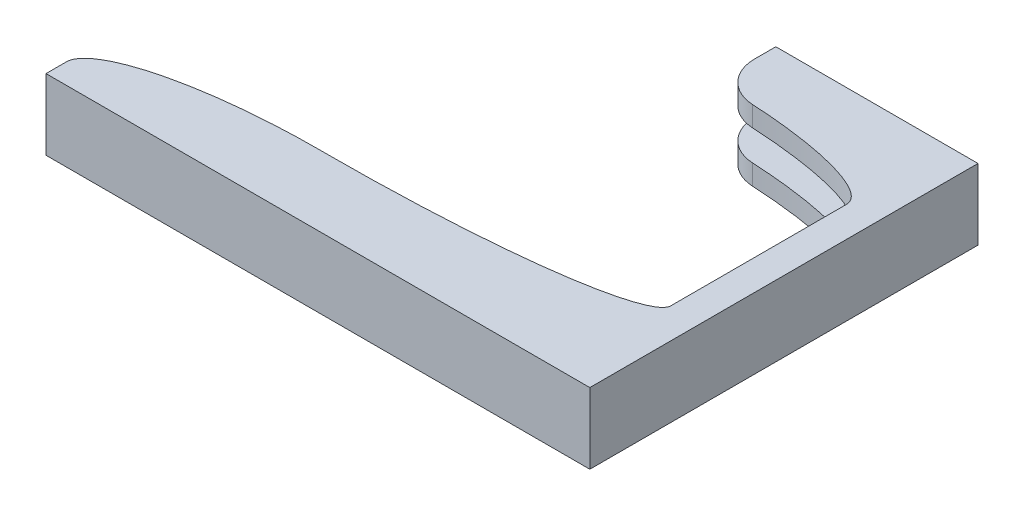
ISO-10303-21;
HEADER;
FILE_DESCRIPTION(('STEP AP214'),'2;1');
FILE_NAME('part.step','',(''),(''),'','','');
FILE_SCHEMA(('AUTOMOTIVE_DESIGN { 1 0 10303 214 1 1 1 1 }'));
ENDSEC;
DATA;
#1=APPLICATION_CONTEXT('core data for automotive mechanical design processes');
#2=APPLICATION_PROTOCOL_DEFINITION('international standard','automotive_design',2000,#1);
#3=PRODUCT_CONTEXT('',#1,'mechanical');
#4=PRODUCT('Part','Part','',(#3));
#5=PRODUCT_RELATED_PRODUCT_CATEGORY('part','',(#4));
#6=PRODUCT_DEFINITION_FORMATION('','',#4);
#7=PRODUCT_DEFINITION_CONTEXT('part definition',#1,'design');
#8=PRODUCT_DEFINITION('design','',#6,#7);
#9=PRODUCT_DEFINITION_SHAPE('','',#8);
#10=(LENGTH_UNIT() NAMED_UNIT(*) SI_UNIT(.MILLI.,.METRE.));
#11=(NAMED_UNIT(*) PLANE_ANGLE_UNIT() SI_UNIT($,.RADIAN.));
#12=(NAMED_UNIT(*) SI_UNIT($,.STERADIAN.) SOLID_ANGLE_UNIT());
#13=UNCERTAINTY_MEASURE_WITH_UNIT(LENGTH_MEASURE(1.E-05),#10,'distance_accuracy_value','');
#14=(GEOMETRIC_REPRESENTATION_CONTEXT(3) GLOBAL_UNCERTAINTY_ASSIGNED_CONTEXT((#13)) GLOBAL_UNIT_ASSIGNED_CONTEXT((#10,
#11,#12)) REPRESENTATION_CONTEXT('',''));
#15=CARTESIAN_POINT('',(0.,0.,0.));
#16=DIRECTION('',(0.,0.,1.));
#17=DIRECTION('',(1.,0.,0.));
#18=AXIS2_PLACEMENT_3D('',#15,#16,#17);
#19=CARTESIAN_POINT('',(-39.2209826108419,2.50000000000001,18.6662596522763));
#20=DIRECTION('',(0.,1.,0.));
#21=DIRECTION('',(0.,0.,1.));
#22=AXIS2_PLACEMENT_3D('',#19,#20,#21);
#23=CYLINDRICAL_SURFACE('',#22,2.);
#24=DIRECTION('',(0.,1.,0.));
#25=VECTOR('',#24,1.);
#26=CARTESIAN_POINT('',(-41.2209826108419,0.,18.6662596522763));
#27=LINE('',#26,#25);
#28=CARTESIAN_POINT('',(-41.2209826108419,2.5,18.6662596522763));
#29=VERTEX_POINT('',#28);
#30=CARTESIAN_POINT('',(-41.2209826108419,3.5,18.6662596522763));
#31=VERTEX_POINT('',#30);
#32=EDGE_CURVE('E655',#29,#31,#27,.T.);
#33=ORIENTED_EDGE('',*,*,#32,.F.);
#34=CARTESIAN_POINT('',(-39.2209826108419,2.5,18.6662596522763));
#35=DIRECTION('',(0.,1.,0.));
#36=DIRECTION('',(0.,0.,1.));
#37=AXIS2_PLACEMENT_3D('',#34,#35,#36);
#38=CIRCLE('',#37,2.);
#39=CARTESIAN_POINT('',(-39.3282724657844,2.5,20.6626418723806));
#40=VERTEX_POINT('',#39);
#41=EDGE_CURVE('E45',#40,#29,#38,.F.);
#42=ORIENTED_EDGE('',*,*,#41,.F.);
#43=DIRECTION('',(0.,1.,0.));
#44=VECTOR('',#43,1.);
#45=CARTESIAN_POINT('',(-39.328310749086,3.5,20.6633777436122));
#46=LINE('',#45,#44);
#47=CARTESIAN_POINT('',(-39.3282723988298,3.5,20.6626404961796));
#48=VERTEX_POINT('',#47);
#49=EDGE_CURVE('E782',#48,#40,#46,.F.);
#50=ORIENTED_EDGE('',*,*,#49,.F.);
#51=CARTESIAN_POINT('',(-39.2209826108419,3.5,18.6662596522763));
#52=DIRECTION('',(0.,-1.,0.));
#53=DIRECTION('',(0.,0.,-1.));
#54=AXIS2_PLACEMENT_3D('',#51,#52,#53);
#55=CIRCLE('',#54,2.);
#56=EDGE_CURVE('E12',#31,#48,#55,.F.);
#57=ORIENTED_EDGE('',*,*,#56,.F.);
#58=EDGE_LOOP('',(#33,#42,#50,#57));
#59=FACE_BOUND('',#58,.T.);
#60=ADVANCED_FACE('F37',(#59),#23,.T.);
#61=CARTESIAN_POINT('',(-39.2209826108419,0.,18.6662596522763));
#62=DIRECTION('',(0.,1.,0.));
#63=DIRECTION('',(0.,0.,1.));
#64=AXIS2_PLACEMENT_3D('',#61,#62,#63);
#65=CYLINDRICAL_SURFACE('',#64,2.);
#66=DIRECTION('',(0.,1.,0.));
#67=VECTOR('',#66,1.);
#68=CARTESIAN_POINT('',(-41.2209826108419,0.,18.6662596522763));
#69=LINE('',#68,#67);
#70=CARTESIAN_POINT('',(-41.2209826108419,0.,18.6662596522763));
#71=VERTEX_POINT('',#70);
#72=CARTESIAN_POINT('',(-41.2209826108419,0.999999999999998,18.6662596522763));
#73=VERTEX_POINT('',#72);
#74=EDGE_CURVE('E640',#71,#73,#69,.T.);
#75=ORIENTED_EDGE('',*,*,#74,.F.);
#76=CARTESIAN_POINT('',(-39.2209826108419,0.,18.6662596522763));
#77=DIRECTION('',(0.,-1.,0.));
#78=DIRECTION('',(0.,0.,-1.));
#79=AXIS2_PLACEMENT_3D('',#76,#77,#78);
#80=CIRCLE('',#79,2.);
#81=CARTESIAN_POINT('',(-39.3282724657844,0.,20.6626418723806));
#82=VERTEX_POINT('',#81);
#83=EDGE_CURVE('E642',#82,#71,#80,.T.);
#84=ORIENTED_EDGE('',*,*,#83,.F.);
#85=DIRECTION('',(0.,1.,0.));
#86=VECTOR('',#85,1.);
#87=CARTESIAN_POINT('',(-39.328310749086,0.999999999999998,20.6633777436122));
#88=LINE('',#87,#86);
#89=CARTESIAN_POINT('',(-39.3282719763754,0.999999999999998,20.6626405187616));
#90=VERTEX_POINT('',#89);
#91=EDGE_CURVE('E639',#90,#82,#88,.F.);
#92=ORIENTED_EDGE('',*,*,#91,.F.);
#93=CARTESIAN_POINT('',(-39.2209826108419,0.999999999999998,18.6662596522763));
#94=DIRECTION('',(0.,-1.,0.));
#95=DIRECTION('',(0.,0.,-1.));
#96=AXIS2_PLACEMENT_3D('',#93,#94,#95);
#97=CIRCLE('',#96,2.);
#98=EDGE_CURVE('E635',#73,#90,#97,.F.);
#99=ORIENTED_EDGE('',*,*,#98,.F.);
#100=EDGE_LOOP('',(#75,#84,#92,#99));
#101=FACE_BOUND('',#100,.T.);
#102=ADVANCED_FACE('F778',(#101),#65,.T.);
#103=CARTESIAN_POINT('',(-58.1209826108419,3.6,35.8131667407842));
#104=CARTESIAN_POINT('',(-58.1209826108419,3.2,35.8131667407842));
#105=CARTESIAN_POINT('',(-58.1209826108419,2.8,35.8131667407842));
#106=CARTESIAN_POINT('',(-58.1209826108419,2.4,35.8131667407842));
#107=CARTESIAN_POINT('',(-58.1209826108419,3.6,33.3131667407841));
#108=CARTESIAN_POINT('',(-58.1209826108419,3.2,33.3131667407841));
#109=CARTESIAN_POINT('',(-58.120982610846,2.8,33.3131667407841));
#110=CARTESIAN_POINT('',(-58.1209826108419,2.4,33.3131667407841));
#111=CARTESIAN_POINT('',(-48.1209826108419,3.6,33.3131667407842));
#112=CARTESIAN_POINT('',(-48.1209826108419,3.2,33.3131667407842));
#113=CARTESIAN_POINT('',(-48.1209826108419,2.8,33.3131667407842));
#114=CARTESIAN_POINT('',(-48.1209826108419,2.4,33.3131667407842));
#115=(BOUNDED_SURFACE() B_SPLINE_SURFACE(2,3,((#103,#104,#105,#106),(#107,#108,#109,#110),(#111,
#112,#113,#114)),.UNSPECIFIED.,.F.,.F.,.F.) B_SPLINE_SURFACE_WITH_KNOTS((3,3),(4,4),(0.,1.),
(-0.0001,0.0011),.UNSPECIFIED.) GEOMETRIC_REPRESENTATION_ITEM() RATIONAL_B_SPLINE_SURFACE(((1.,
1.,1.,1.),(0.707106781186547,0.707106781186547,0.707106781186547,0.707106781186547),(1.,1.,1.,1.))) REPRESENTATION_ITEM('') SURFACE());
#116=CARTESIAN_POINT('',(-58.1209826108419,2.4,35.8131667407842));
#117=CARTESIAN_POINT('',(-58.1209826108419,2.8,35.8131667407842));
#118=CARTESIAN_POINT('',(-58.1209826108419,3.2,35.8131667407842));
#119=CARTESIAN_POINT('',(-58.1209826108419,3.6,35.8131667407842));
#120=(BOUNDED_CURVE() B_SPLINE_CURVE(3,(#116,#117,#118,#119),.UNSPECIFIED.,.F.,
.F.) B_SPLINE_CURVE_WITH_KNOTS((4,4),(-0.0001,0.0011),
.UNSPECIFIED.) CURVE() GEOMETRIC_REPRESENTATION_ITEM() RATIONAL_B_SPLINE_CURVE((1.,1.,1.,1.)) REPRESENTATION_ITEM(''));
#121=CARTESIAN_POINT('',(-58.1209826108419,3.5,35.8131667407842));
#122=VERTEX_POINT('',#121);
#123=CARTESIAN_POINT('',(-58.1209826108419,2.5,35.8131667407842));
#124=VERTEX_POINT('',#123);
#125=EDGE_CURVE('E699',#122,#124,#120,.F.);
#126=CARTESIAN_POINT('',(-58.1209826108419,3.5,35.8131667407842));
#127=CARTESIAN_POINT('',(-58.120982610842,3.5,33.3131667407841));
#128=CARTESIAN_POINT('',(-48.1209826108419,3.5,33.3131667407842));
#129=(BOUNDED_CURVE() B_SPLINE_CURVE(2,(#126,#127,#128),.UNSPECIFIED.,.F.,
.F.) B_SPLINE_CURVE_WITH_KNOTS((3,3),(0.,1.),
.UNSPECIFIED.) CURVE() GEOMETRIC_REPRESENTATION_ITEM() RATIONAL_B_SPLINE_CURVE((1.,
0.707106781186547,1.)) REPRESENTATION_ITEM(''));
#130=CARTESIAN_POINT('',(-48.1209826108419,3.5,33.3131667407842));
#131=VERTEX_POINT('',#130);
#132=EDGE_CURVE('E705',#131,#122,#129,.F.);
#133=CARTESIAN_POINT('',(-48.1209826108419,3.6,33.3131667407842));
#134=CARTESIAN_POINT('',(-48.1209826108419,3.2,33.3131667407842));
#135=CARTESIAN_POINT('',(-48.1209826108419,2.8,33.3131667407842));
#136=CARTESIAN_POINT('',(-48.1209826108419,2.4,33.3131667407842));
#137=(BOUNDED_CURVE() B_SPLINE_CURVE(3,(#133,#134,#135,#136),.UNSPECIFIED.,.F.,
.F.) B_SPLINE_CURVE_WITH_KNOTS((4,4),(-0.0001,0.0011),
.UNSPECIFIED.) CURVE() GEOMETRIC_REPRESENTATION_ITEM() RATIONAL_B_SPLINE_CURVE((1.,1.,1.,1.)) REPRESENTATION_ITEM(''));
#138=CARTESIAN_POINT('',(-48.1209826108419,2.5,33.3131667407842));
#139=VERTEX_POINT('',#138);
#140=EDGE_CURVE('E703',#139,#131,#137,.F.);
#141=CARTESIAN_POINT('',(-48.1209826108419,2.5,33.3131667407842));
#142=CARTESIAN_POINT('',(-58.1209826108427,2.5,33.3131667407841));
#143=CARTESIAN_POINT('',(-58.1209826108419,2.5,35.8131667407842));
#144=(BOUNDED_CURVE() B_SPLINE_CURVE(2,(#141,#142,#143),.UNSPECIFIED.,.F.,
.F.) B_SPLINE_CURVE_WITH_KNOTS((3,3),(0.,1.),
.UNSPECIFIED.) CURVE() GEOMETRIC_REPRESENTATION_ITEM() RATIONAL_B_SPLINE_CURVE((1.,
0.707106781186547,1.)) REPRESENTATION_ITEM(''));
#145=EDGE_CURVE('E564',#124,#139,#144,.F.);
#146=ORIENTED_EDGE('',*,*,#125,.F.);
#147=ORIENTED_EDGE('',*,*,#132,.F.);
#148=ORIENTED_EDGE('',*,*,#140,.F.);
#149=ORIENTED_EDGE('',*,*,#145,.F.);
#150=EDGE_LOOP('',(#146,#147,#148,#149));
#151=FACE_BOUND('',#150,.T.);
#152=ADVANCED_FACE('F394',(#151),#115,.T.);
#153=CARTESIAN_POINT('',(-58.1209826108419,1.1,35.8131667407842));
#154=CARTESIAN_POINT('',(-58.1209826108419,0.7,35.8131667407842));
#155=CARTESIAN_POINT('',(-58.1209826108419,0.3,35.8131667407842));
#156=CARTESIAN_POINT('',(-58.1209826108419,-0.0999999999999998,35.8131667407842));
#157=CARTESIAN_POINT('',(-58.1209826108419,1.1,33.3131667407841));
#158=CARTESIAN_POINT('',(-58.120982610846,0.7,33.3131667407841));
#159=CARTESIAN_POINT('',(-58.1209826108419,0.3,33.3131667407841));
#160=CARTESIAN_POINT('',(-58.1209826108419,-0.0999999999999998,33.3131667407841));
#161=CARTESIAN_POINT('',(-48.1209826108419,1.1,33.3131667407842));
#162=CARTESIAN_POINT('',(-48.1209826108419,0.7,33.3131667407842));
#163=CARTESIAN_POINT('',(-48.1209826108419,0.3,33.3131667407842));
#164=CARTESIAN_POINT('',(-48.1209826108419,-0.0999999999999998,33.3131667407842));
#165=(BOUNDED_SURFACE() B_SPLINE_SURFACE(2,3,((#153,#154,#155,#156),(#157,#158,#159,#160),(#161,
#162,#163,#164)),.UNSPECIFIED.,.F.,.F.,.F.) B_SPLINE_SURFACE_WITH_KNOTS((3,3),(4,4),(0.,1.),
(0.0024,0.0036),.UNSPECIFIED.) GEOMETRIC_REPRESENTATION_ITEM() RATIONAL_B_SPLINE_SURFACE(((1.,
1.,1.,1.),(0.707106781186547,0.707106781186547,0.707106781186547,0.707106781186547),(1.,1.,1.,1.))) REPRESENTATION_ITEM('') SURFACE());
#166=CARTESIAN_POINT('',(-58.1209826108419,-0.0999999999999998,35.8131667407842));
#167=CARTESIAN_POINT('',(-58.1209826108419,0.3,35.8131667407842));
#168=CARTESIAN_POINT('',(-58.1209826108419,0.7,35.8131667407842));
#169=CARTESIAN_POINT('',(-58.1209826108419,1.1,35.8131667407842));
#170=(BOUNDED_CURVE() B_SPLINE_CURVE(3,(#166,#167,#168,#169),.UNSPECIFIED.,.F.,
.F.) B_SPLINE_CURVE_WITH_KNOTS((4,4),(0.0024,0.0036),
.UNSPECIFIED.) CURVE() GEOMETRIC_REPRESENTATION_ITEM() RATIONAL_B_SPLINE_CURVE((1.,1.,1.,1.)) REPRESENTATION_ITEM(''));
#171=CARTESIAN_POINT('',(-58.1209826108419,1.,35.8131667407842));
#172=VERTEX_POINT('',#171);
#173=CARTESIAN_POINT('',(-58.1209826108419,0.,35.8131667407842));
#174=VERTEX_POINT('',#173);
#175=EDGE_CURVE('E467',#172,#174,#170,.F.);
#176=CARTESIAN_POINT('',(-58.1209826108418,1.,35.8131667407842));
#177=CARTESIAN_POINT('',(-58.1209826108427,1.,33.3131667407841));
#178=CARTESIAN_POINT('',(-48.1209826108419,1.,33.3131667407842));
#179=(BOUNDED_CURVE() B_SPLINE_CURVE(2,(#176,#177,#178),.UNSPECIFIED.,.F.,
.F.) B_SPLINE_CURVE_WITH_KNOTS((3,3),(0.,1.),
.UNSPECIFIED.) CURVE() GEOMETRIC_REPRESENTATION_ITEM() RATIONAL_B_SPLINE_CURVE((1.,
0.707106781186547,1.)) REPRESENTATION_ITEM(''));
#180=CARTESIAN_POINT('',(-48.1209826108419,1.,33.3131667407842));
#181=VERTEX_POINT('',#180);
#182=EDGE_CURVE('E605',#181,#172,#179,.F.);
#183=CARTESIAN_POINT('',(-48.1209826108419,1.1,33.3131667407842));
#184=CARTESIAN_POINT('',(-48.1209826108419,0.7,33.3131667407842));
#185=CARTESIAN_POINT('',(-48.1209826108419,0.3,33.3131667407842));
#186=CARTESIAN_POINT('',(-48.1209826108419,-0.0999999999999998,33.3131667407842));
#187=(BOUNDED_CURVE() B_SPLINE_CURVE(3,(#183,#184,#185,#186),.UNSPECIFIED.,.F.,
.F.) B_SPLINE_CURVE_WITH_KNOTS((4,4),(0.0024,0.0036),
.UNSPECIFIED.) CURVE() GEOMETRIC_REPRESENTATION_ITEM() RATIONAL_B_SPLINE_CURVE((1.,1.,1.,1.)) REPRESENTATION_ITEM(''));
#188=CARTESIAN_POINT('',(-48.1209826108419,0.,33.3131667407842));
#189=VERTEX_POINT('',#188);
#190=EDGE_CURVE('E593',#189,#181,#187,.F.);
#191=CARTESIAN_POINT('',(-48.1209826108419,0.,33.3131667407842));
#192=CARTESIAN_POINT('',(-58.1209826108419,0.,33.3131667407841));
#193=CARTESIAN_POINT('',(-58.1209826108419,0.,35.8131667407842));
#194=(BOUNDED_CURVE() B_SPLINE_CURVE(2,(#191,#192,#193),.UNSPECIFIED.,.F.,
.F.) B_SPLINE_CURVE_WITH_KNOTS((3,3),(0.,1.),
.UNSPECIFIED.) CURVE() GEOMETRIC_REPRESENTATION_ITEM() RATIONAL_B_SPLINE_CURVE((1.,
0.707106781186547,1.)) REPRESENTATION_ITEM(''));
#195=EDGE_CURVE('E704',#174,#189,#194,.F.);
#196=ORIENTED_EDGE('',*,*,#175,.F.);
#197=ORIENTED_EDGE('',*,*,#182,.F.);
#198=ORIENTED_EDGE('',*,*,#190,.F.);
#199=ORIENTED_EDGE('',*,*,#195,.F.);
#200=EDGE_LOOP('',(#196,#197,#198,#199));
#201=FACE_BOUND('',#200,.T.);
#202=ADVANCED_FACE('F380',(#201),#165,.T.);
#203=CARTESIAN_POINT('',(-41.2209826108419,2.4,20.6131667407842));
#204=CARTESIAN_POINT('',(-41.2209826108419,2.8,20.6131667407842));
#205=CARTESIAN_POINT('',(-41.2209826108419,3.2,20.6131667407842));
#206=CARTESIAN_POINT('',(-41.2209826108419,3.6,20.6131667407842));
#207=CARTESIAN_POINT('',(-32.7209826108419,2.4,20.6131667407842));
#208=CARTESIAN_POINT('',(-32.7209826108419,2.8,20.6131667407842));
#209=CARTESIAN_POINT('',(-32.7209826108419,3.2,20.6131667407842));
#210=CARTESIAN_POINT('',(-32.7209826108419,3.6,20.6131667407842));
#211=CARTESIAN_POINT('',(-32.7209826108419,2.4,22.6131667407842));
#212=CARTESIAN_POINT('',(-32.7209826108419,2.8,22.6131667407842));
#213=CARTESIAN_POINT('',(-32.7209826108419,3.2,22.6131667407842));
#214=CARTESIAN_POINT('',(-32.7209826108419,3.6,22.6131667407842));
#215=(BOUNDED_SURFACE() B_SPLINE_SURFACE(2,3,((#203,#204,#205,#206),(#207,#208,#209,#210),(#211,
#212,#213,#214)),.UNSPECIFIED.,.F.,.F.,.F.) B_SPLINE_SURFACE_WITH_KNOTS((3,3),(4,4),(0.,1.),
(0.0024,0.0036),.UNSPECIFIED.) GEOMETRIC_REPRESENTATION_ITEM() RATIONAL_B_SPLINE_SURFACE(((1.,
1.,1.,1.),(0.707106781186548,0.707106781186548,0.707106781186548,0.707106781186548),(1.,1.,1.,1.))) REPRESENTATION_ITEM('') SURFACE());
#216=CARTESIAN_POINT('',(-32.7209826108419,3.5,22.6131667407842));
#217=CARTESIAN_POINT('',(-32.7209826108419,3.5,20.6131667407842));
#218=CARTESIAN_POINT('',(-41.2209826108419,3.5,20.6131667407842));
#219=(BOUNDED_CURVE() B_SPLINE_CURVE(2,(#216,#217,#218),.UNSPECIFIED.,.F.,
.F.) B_SPLINE_CURVE_WITH_KNOTS((3,3),(0.,1.),
.UNSPECIFIED.) CURVE() GEOMETRIC_REPRESENTATION_ITEM() RATIONAL_B_SPLINE_CURVE((1.,
0.707106781186548,1.)) REPRESENTATION_ITEM(''));
#220=CARTESIAN_POINT('',(-32.7209826108419,3.5,22.6131667407842));
#221=VERTEX_POINT('',#220);
#222=EDGE_CURVE('E536',#221,#48,#219,.T.);
#223=CARTESIAN_POINT('',(-41.2209826108419,2.5,20.6131667407842));
#224=CARTESIAN_POINT('',(-32.7209826108419,2.5,20.6131667407842));
#225=CARTESIAN_POINT('',(-32.7209826108419,2.5,22.6131667407842));
#226=(BOUNDED_CURVE() B_SPLINE_CURVE(2,(#223,#224,#225),.UNSPECIFIED.,.F.,
.F.) B_SPLINE_CURVE_WITH_KNOTS((3,3),(0.,1.),
.UNSPECIFIED.) CURVE() GEOMETRIC_REPRESENTATION_ITEM() RATIONAL_B_SPLINE_CURVE((1.,
0.707106781186548,1.)) REPRESENTATION_ITEM(''));
#227=CARTESIAN_POINT('',(-32.7209826108419,2.5,22.6131667407842));
#228=VERTEX_POINT('',#227);
#229=EDGE_CURVE('E540',#40,#228,#226,.T.);
#230=CARTESIAN_POINT('',(-32.7209826108419,2.4,22.6131667407842));
#231=CARTESIAN_POINT('',(-32.7209826108419,2.8,22.6131667407842));
#232=CARTESIAN_POINT('',(-32.7209826108419,3.2,22.6131667407842));
#233=CARTESIAN_POINT('',(-32.7209826108419,3.6,22.6131667407842));
#234=(BOUNDED_CURVE() B_SPLINE_CURVE(3,(#230,#231,#232,#233),.UNSPECIFIED.,.F.,
.F.) B_SPLINE_CURVE_WITH_KNOTS((4,4),(0.0024,0.0036),
.UNSPECIFIED.) CURVE() GEOMETRIC_REPRESENTATION_ITEM() RATIONAL_B_SPLINE_CURVE((1.,1.,1.,1.)) REPRESENTATION_ITEM(''));
#235=EDGE_CURVE('E231',#221,#228,#234,.F.);
#236=ORIENTED_EDGE('',*,*,#222,.T.);
#237=ORIENTED_EDGE('',*,*,#49,.T.);
#238=ORIENTED_EDGE('',*,*,#229,.T.);
#239=ORIENTED_EDGE('',*,*,#235,.F.);
#240=EDGE_LOOP('',(#236,#237,#238,#239));
#241=FACE_BOUND('',#240,.T.);
#242=ADVANCED_FACE('F309',(#241),#215,.T.);
#243=CARTESIAN_POINT('',(-41.2209826108419,-0.0999999999999999,20.6131667407842));
#244=CARTESIAN_POINT('',(-41.2209826108419,0.3,20.6131667407842));
#245=CARTESIAN_POINT('',(-41.2209826108419,0.699999999999999,20.6131667407842));
#246=CARTESIAN_POINT('',(-41.2209826108419,1.1,20.6131667407842));
#247=CARTESIAN_POINT('',(-32.7209826108419,-0.0999999999999998,20.6131667407842));
#248=CARTESIAN_POINT('',(-32.7209826108419,0.3,20.6131667407842));
#249=CARTESIAN_POINT('',(-32.7209826108419,0.699999999999999,20.6131667407842));
#250=CARTESIAN_POINT('',(-32.7209826108419,1.1,20.6131667407842));
#251=CARTESIAN_POINT('',(-32.7209826108419,-0.0999999999999999,22.6131667407842));
#252=CARTESIAN_POINT('',(-32.7209826108419,0.3,22.6131667407842));
#253=CARTESIAN_POINT('',(-32.7209826108419,0.699999999999999,22.6131667407842));
#254=CARTESIAN_POINT('',(-32.7209826108419,1.1,22.6131667407842));
#255=(BOUNDED_SURFACE() B_SPLINE_SURFACE(2,3,((#243,#244,#245,#246),(#247,#248,#249,#250),(#251,
#252,#253,#254)),.UNSPECIFIED.,.F.,.F.,.F.) B_SPLINE_SURFACE_WITH_KNOTS((3,3),(4,4),(0.,1.),
(-9.99999999999999E-05,0.0011),
.UNSPECIFIED.) GEOMETRIC_REPRESENTATION_ITEM() RATIONAL_B_SPLINE_SURFACE(((1.,1.,1.,1.),
(0.707106781186548,0.707106781186548,0.707106781186548,0.707106781186548),(1.,1.,1.,1.))) REPRESENTATION_ITEM('') SURFACE());
#256=CARTESIAN_POINT('',(-32.7209826108419,0.999999999999998,22.6131667407842));
#257=CARTESIAN_POINT('',(-32.7209826108419,0.999999999999998,20.6131667407842));
#258=CARTESIAN_POINT('',(-41.2209826108419,0.999999999999998,20.6131667407842));
#259=(BOUNDED_CURVE() B_SPLINE_CURVE(2,(#256,#257,#258),.UNSPECIFIED.,.F.,
.F.) B_SPLINE_CURVE_WITH_KNOTS((3,3),(0.,1.),
.UNSPECIFIED.) CURVE() GEOMETRIC_REPRESENTATION_ITEM() RATIONAL_B_SPLINE_CURVE((1.,
0.707106781186548,1.)) REPRESENTATION_ITEM(''));
#260=CARTESIAN_POINT('',(-32.7209826108419,0.999999999999999,22.6131667407842));
#261=VERTEX_POINT('',#260);
#262=EDGE_CURVE('E545',#261,#90,#259,.T.);
#263=CARTESIAN_POINT('',(-41.2209826108419,0.,20.6131667407842));
#264=CARTESIAN_POINT('',(-32.7209826108419,0.,20.6131667407842));
#265=CARTESIAN_POINT('',(-32.7209826108419,0.,22.6131667407842));
#266=(BOUNDED_CURVE() B_SPLINE_CURVE(2,(#263,#264,#265),.UNSPECIFIED.,.F.,
.F.) B_SPLINE_CURVE_WITH_KNOTS((3,3),(0.,1.),
.UNSPECIFIED.) CURVE() GEOMETRIC_REPRESENTATION_ITEM() RATIONAL_B_SPLINE_CURVE((1.,
0.707106781186548,1.)) REPRESENTATION_ITEM(''));
#267=CARTESIAN_POINT('',(-32.7209826108419,0.,22.6131667407842));
#268=VERTEX_POINT('',#267);
#269=EDGE_CURVE('E544',#82,#268,#266,.T.);
#270=CARTESIAN_POINT('',(-32.7209826108419,-0.0999999999999999,22.6131667407842));
#271=CARTESIAN_POINT('',(-32.7209826108419,0.3,22.6131667407842));
#272=CARTESIAN_POINT('',(-32.7209826108419,0.699999999999999,22.6131667407842));
#273=CARTESIAN_POINT('',(-32.7209826108419,1.1,22.6131667407842));
#274=(BOUNDED_CURVE() B_SPLINE_CURVE(3,(#270,#271,#272,#273),.UNSPECIFIED.,.F.,
.F.) B_SPLINE_CURVE_WITH_KNOTS((4,4),(-9.99999999999999E-05,0.0011),
.UNSPECIFIED.) CURVE() GEOMETRIC_REPRESENTATION_ITEM() RATIONAL_B_SPLINE_CURVE((1.,1.,1.,1.)) REPRESENTATION_ITEM(''));
#275=EDGE_CURVE('E283',#261,#268,#274,.F.);
#276=ORIENTED_EDGE('',*,*,#262,.T.);
#277=ORIENTED_EDGE('',*,*,#91,.T.);
#278=ORIENTED_EDGE('',*,*,#269,.T.);
#279=ORIENTED_EDGE('',*,*,#275,.F.);
#280=EDGE_LOOP('',(#276,#277,#278,#279));
#281=FACE_BOUND('',#280,.T.);
#282=ADVANCED_FACE('F292',(#281),#255,.T.);
#283=CARTESIAN_POINT('',(-47.7209826108419,3.6,33.3131667407842));
#284=CARTESIAN_POINT('',(-47.7209826108419,3.2,33.3131667407842));
#285=CARTESIAN_POINT('',(-47.7209826108419,2.8,33.3131667407842));
#286=CARTESIAN_POINT('',(-47.7209826108419,2.4,33.3131667407842));
#287=CARTESIAN_POINT('',(-32.7209826108419,3.6,33.3131667407842));
#288=CARTESIAN_POINT('',(-32.7209826108419,3.2,33.3131667407842));
#289=CARTESIAN_POINT('',(-32.7209826108419,2.8,33.3131667407842));
#290=CARTESIAN_POINT('',(-32.7209826108419,2.4,33.3131667407842));
#291=CARTESIAN_POINT('',(-32.7209826108419,3.6,31.3131667407842));
#292=CARTESIAN_POINT('',(-32.7209826108419,3.2,31.3131667407842));
#293=CARTESIAN_POINT('',(-32.7209826108419,2.8,31.3131667407842));
#294=CARTESIAN_POINT('',(-32.7209826108419,2.4,31.3131667407842));
#295=(BOUNDED_SURFACE() B_SPLINE_SURFACE(2,3,((#283,#284,#285,#286),(#287,#288,#289,#290),(#291,
#292,#293,#294)),.UNSPECIFIED.,.F.,.F.,.F.) B_SPLINE_SURFACE_WITH_KNOTS((3,3),(4,4),(0.,1.),
(-0.0036,-0.0024),.UNSPECIFIED.) GEOMETRIC_REPRESENTATION_ITEM() RATIONAL_B_SPLINE_SURFACE(((1.,
1.,1.,1.),(0.707106781186548,0.707106781186548,0.707106781186548,0.707106781186548),(1.,1.,1.,1.))) REPRESENTATION_ITEM('') SURFACE());
#296=CARTESIAN_POINT('',(-32.7209826108419,3.6,31.3131667407842));
#297=CARTESIAN_POINT('',(-32.7209826108419,3.2,31.3131667407842));
#298=CARTESIAN_POINT('',(-32.7209826108419,2.8,31.3131667407842));
#299=CARTESIAN_POINT('',(-32.7209826108419,2.4,31.3131667407842));
#300=(BOUNDED_CURVE() B_SPLINE_CURVE(3,(#296,#297,#298,#299),.UNSPECIFIED.,.F.,
.F.) B_SPLINE_CURVE_WITH_KNOTS((4,4),(-0.0036,-0.0024),
.UNSPECIFIED.) CURVE() GEOMETRIC_REPRESENTATION_ITEM() RATIONAL_B_SPLINE_CURVE((1.,1.,1.,1.)) REPRESENTATION_ITEM(''));
#301=CARTESIAN_POINT('',(-32.7209826108419,2.5,31.3131667407842));
#302=VERTEX_POINT('',#301);
#303=CARTESIAN_POINT('',(-32.7209826108419,3.5,31.3131667407842));
#304=VERTEX_POINT('',#303);
#305=EDGE_CURVE('E522',#302,#304,#300,.F.);
#306=CARTESIAN_POINT('',(-32.7209826108419,2.5,31.3131667407842));
#307=CARTESIAN_POINT('',(-32.7209826108419,2.5,33.3131667407842));
#308=CARTESIAN_POINT('',(-47.7209826108419,2.5,33.3131667407842));
#309=(BOUNDED_CURVE() B_SPLINE_CURVE(2,(#306,#307,#308),.UNSPECIFIED.,.F.,
.F.) B_SPLINE_CURVE_WITH_KNOTS((3,3),(0.,1.),
.UNSPECIFIED.) CURVE() GEOMETRIC_REPRESENTATION_ITEM() RATIONAL_B_SPLINE_CURVE((1.,
0.707106781186548,1.)) REPRESENTATION_ITEM(''));
#310=CARTESIAN_POINT('',(-47.7209826108419,2.5,33.3131667407842));
#311=VERTEX_POINT('',#310);
#312=EDGE_CURVE('E552',#302,#311,#309,.T.);
#313=CARTESIAN_POINT('',(-47.7209826108419,2.4,33.3131667407842));
#314=CARTESIAN_POINT('',(-47.7209826108419,2.8,33.3131667407842));
#315=CARTESIAN_POINT('',(-47.7209826108419,3.2,33.3131667407842));
#316=CARTESIAN_POINT('',(-47.7209826108419,3.6,33.3131667407842));
#317=(BOUNDED_CURVE() B_SPLINE_CURVE(3,(#313,#314,#315,#316),.UNSPECIFIED.,.F.,
.F.) B_SPLINE_CURVE_WITH_KNOTS((4,4),(-0.0036,-0.0024),
.UNSPECIFIED.) CURVE() GEOMETRIC_REPRESENTATION_ITEM() RATIONAL_B_SPLINE_CURVE((1.,1.,1.,1.)) REPRESENTATION_ITEM(''));
#318=CARTESIAN_POINT('',(-47.7209826108419,3.5,33.3131667407842));
#319=VERTEX_POINT('',#318);
#320=EDGE_CURVE('E527',#319,#311,#317,.F.);
#321=CARTESIAN_POINT('',(-47.7209826108419,3.5,33.3131667407842));
#322=CARTESIAN_POINT('',(-32.7209826108419,3.5,33.3131667407842));
#323=CARTESIAN_POINT('',(-32.7209826108419,3.5,31.3131667407842));
#324=(BOUNDED_CURVE() B_SPLINE_CURVE(2,(#321,#322,#323),.UNSPECIFIED.,.F.,
.F.) B_SPLINE_CURVE_WITH_KNOTS((3,3),(0.,1.),
.UNSPECIFIED.) CURVE() GEOMETRIC_REPRESENTATION_ITEM() RATIONAL_B_SPLINE_CURVE((1.,
0.707106781186548,1.)) REPRESENTATION_ITEM(''));
#325=EDGE_CURVE('E532',#319,#304,#324,.T.);
#326=ORIENTED_EDGE('',*,*,#305,.F.);
#327=ORIENTED_EDGE('',*,*,#312,.T.);
#328=ORIENTED_EDGE('',*,*,#320,.F.);
#329=ORIENTED_EDGE('',*,*,#325,.T.);
#330=EDGE_LOOP('',(#326,#327,#328,#329));
#331=FACE_BOUND('',#330,.T.);
#332=ADVANCED_FACE('F308',(#331),#295,.T.);
#333=CARTESIAN_POINT('',(-47.7209826108419,1.1,33.3131667407842));
#334=CARTESIAN_POINT('',(-47.7209826108419,0.7,33.3131667407842));
#335=CARTESIAN_POINT('',(-47.7209826108419,0.3,33.3131667407842));
#336=CARTESIAN_POINT('',(-47.7209826108419,-0.1,33.3131667407842));
#337=CARTESIAN_POINT('',(-32.7209826108419,1.1,33.3131667407842));
#338=CARTESIAN_POINT('',(-32.7209826108419,0.699999999999999,33.3131667407842));
#339=CARTESIAN_POINT('',(-32.7209826108419,0.300000000000001,33.3131667407842));
#340=CARTESIAN_POINT('',(-32.7209826108419,-0.1,33.3131667407842));
#341=CARTESIAN_POINT('',(-32.7209826108419,1.1,31.3131667407842));
#342=CARTESIAN_POINT('',(-32.7209826108419,0.7,31.3131667407842));
#343=CARTESIAN_POINT('',(-32.7209826108419,0.3,31.3131667407842));
#344=CARTESIAN_POINT('',(-32.7209826108419,-0.1,31.3131667407842));
#345=(BOUNDED_SURFACE() B_SPLINE_SURFACE(2,3,((#333,#334,#335,#336),(#337,#338,#339,#340),(#341,
#342,#343,#344)),.UNSPECIFIED.,.F.,.F.,.F.) B_SPLINE_SURFACE_WITH_KNOTS((3,3),(4,4),(0.,1.),
(-0.0011,0.0001),.UNSPECIFIED.) GEOMETRIC_REPRESENTATION_ITEM() RATIONAL_B_SPLINE_SURFACE(((1.,
1.,1.,1.),(0.707106781186548,0.707106781186548,0.707106781186548,0.707106781186548),(1.,1.,1.,1.))) REPRESENTATION_ITEM('') SURFACE());
#346=CARTESIAN_POINT('',(-32.7209826108419,1.1,31.3131667407842));
#347=CARTESIAN_POINT('',(-32.7209826108419,0.7,31.3131667407842));
#348=CARTESIAN_POINT('',(-32.7209826108419,0.3,31.3131667407842));
#349=CARTESIAN_POINT('',(-32.7209826108419,-0.1,31.3131667407842));
#350=(BOUNDED_CURVE() B_SPLINE_CURVE(3,(#346,#347,#348,#349),.UNSPECIFIED.,.F.,
.F.) B_SPLINE_CURVE_WITH_KNOTS((4,4),(-0.0011,0.0001),
.UNSPECIFIED.) CURVE() GEOMETRIC_REPRESENTATION_ITEM() RATIONAL_B_SPLINE_CURVE((1.,1.,1.,1.)) REPRESENTATION_ITEM(''));
#351=CARTESIAN_POINT('',(-32.7209826108419,0.,31.3131667407842));
#352=VERTEX_POINT('',#351);
#353=CARTESIAN_POINT('',(-32.7209826108419,1.,31.3131667407842));
#354=VERTEX_POINT('',#353);
#355=EDGE_CURVE('E688',#352,#354,#350,.F.);
#356=CARTESIAN_POINT('',(-32.7209826108419,0.,31.3131667407842));
#357=CARTESIAN_POINT('',(-32.7209826108419,0.,33.3131667407842));
#358=CARTESIAN_POINT('',(-47.7209826108419,0.,33.3131667407842));
#359=(BOUNDED_CURVE() B_SPLINE_CURVE(2,(#356,#357,#358),.UNSPECIFIED.,.F.,
.F.) B_SPLINE_CURVE_WITH_KNOTS((3,3),(0.,1.),
.UNSPECIFIED.) CURVE() GEOMETRIC_REPRESENTATION_ITEM() RATIONAL_B_SPLINE_CURVE((1.,
0.707106781186548,1.)) REPRESENTATION_ITEM(''));
#360=CARTESIAN_POINT('',(-47.7209826108419,0.,33.3131667407842));
#361=VERTEX_POINT('',#360);
#362=EDGE_CURVE('E694',#352,#361,#359,.T.);
#363=CARTESIAN_POINT('',(-47.7209826108419,-0.1,33.3131667407842));
#364=CARTESIAN_POINT('',(-47.7209826108419,0.3,33.3131667407842));
#365=CARTESIAN_POINT('',(-47.7209826108419,0.7,33.3131667407842));
#366=CARTESIAN_POINT('',(-47.7209826108419,1.1,33.3131667407842));
#367=(BOUNDED_CURVE() B_SPLINE_CURVE(3,(#363,#364,#365,#366),.UNSPECIFIED.,.F.,
.F.) B_SPLINE_CURVE_WITH_KNOTS((4,4),(-0.0011,0.0001),
.UNSPECIFIED.) CURVE() GEOMETRIC_REPRESENTATION_ITEM() RATIONAL_B_SPLINE_CURVE((1.,1.,1.,1.)) REPRESENTATION_ITEM(''));
#368=CARTESIAN_POINT('',(-47.7209826108419,1.,33.3131667407842));
#369=VERTEX_POINT('',#368);
#370=EDGE_CURVE('E692',#369,#361,#367,.F.);
#371=CARTESIAN_POINT('',(-47.7209826108419,1.,33.3131667407842));
#372=CARTESIAN_POINT('',(-32.7209826108419,0.999999999999999,33.3131667407842));
#373=CARTESIAN_POINT('',(-32.7209826108419,1.,31.3131667407842));
#374=(BOUNDED_CURVE() B_SPLINE_CURVE(2,(#371,#372,#373),.UNSPECIFIED.,.F.,
.F.) B_SPLINE_CURVE_WITH_KNOTS((3,3),(0.,1.),
.UNSPECIFIED.) CURVE() GEOMETRIC_REPRESENTATION_ITEM() RATIONAL_B_SPLINE_CURVE((1.,
0.707106781186548,1.)) REPRESENTATION_ITEM(''));
#375=EDGE_CURVE('E528',#369,#354,#374,.T.);
#376=ORIENTED_EDGE('',*,*,#355,.F.);
#377=ORIENTED_EDGE('',*,*,#362,.T.);
#378=ORIENTED_EDGE('',*,*,#370,.F.);
#379=ORIENTED_EDGE('',*,*,#375,.T.);
#380=EDGE_LOOP('',(#376,#377,#378,#379));
#381=FACE_BOUND('',#380,.T.);
#382=ADVANCED_FACE('F487',(#381),#345,.T.);
#383=CARTESIAN_POINT('',(-32.7209826108419,0.,33.3131667407842));
#384=DIRECTION('',(1.,0.,0.));
#385=DIRECTION('',(0.,0.,-1.));
#386=AXIS2_PLACEMENT_3D('',#383,#384,#385);
#387=PLANE('',#386);
#388=DIRECTION('',(0.,0.,-1.));
#389=VECTOR('',#388,1.);
#390=CARTESIAN_POINT('',(-32.7209826108419,1.,33.3131667407842));
#391=LINE('',#390,#389);
#392=EDGE_CURVE('E634',#354,#261,#391,.T.);
#393=ORIENTED_EDGE('',*,*,#392,.T.);
#394=ORIENTED_EDGE('',*,*,#275,.T.);
#395=DIRECTION('',(0.,0.,-1.));
#396=VECTOR('',#395,1.);
#397=CARTESIAN_POINT('',(-32.7209826108419,0.,33.3131667407842));
#398=LINE('',#397,#396);
#399=EDGE_CURVE('E586',#352,#268,#398,.T.);
#400=ORIENTED_EDGE('',*,*,#399,.F.);
#401=ORIENTED_EDGE('',*,*,#355,.T.);
#402=EDGE_LOOP('',(#393,#394,#400,#401));
#403=FACE_BOUND('',#402,.T.);
#404=ADVANCED_FACE('F250',(#403),#387,.F.);
#405=CARTESIAN_POINT('',(-58.1209826108419,0.,33.3131667407842));
#406=DIRECTION('',(0.,0.,1.));
#407=DIRECTION('',(1.,0.,0.));
#408=AXIS2_PLACEMENT_3D('',#405,#406,#407);
#409=PLANE('',#408);
#410=DIRECTION('',(1.,0.,0.));
#411=VECTOR('',#410,1.);
#412=CARTESIAN_POINT('',(-58.1209826108419,0.,33.3131667407842));
#413=LINE('',#412,#411);
#414=EDGE_CURVE('E584',#189,#361,#413,.T.);
#415=ORIENTED_EDGE('',*,*,#414,.F.);
#416=ORIENTED_EDGE('',*,*,#190,.T.);
#417=DIRECTION('',(1.,0.,0.));
#418=VECTOR('',#417,1.);
#419=CARTESIAN_POINT('',(-58.1209826108419,1.,33.3131667407842));
#420=LINE('',#419,#418);
#421=EDGE_CURVE('E567',#181,#369,#420,.T.);
#422=ORIENTED_EDGE('',*,*,#421,.T.);
#423=ORIENTED_EDGE('',*,*,#370,.T.);
#424=EDGE_LOOP('',(#415,#416,#422,#423));
#425=FACE_BOUND('',#424,.T.);
#426=ADVANCED_FACE('F484',(#425),#409,.F.);
#427=CARTESIAN_POINT('',(-58.1209826108419,3.5,36.8131667407842));
#428=DIRECTION('',(1.,0.,0.));
#429=DIRECTION('',(0.,0.,-1.));
#430=AXIS2_PLACEMENT_3D('',#427,#428,#429);
#431=PLANE('',#430);
#432=DIRECTION('',(0.,0.,1.));
#433=VECTOR('',#432,1.);
#434=CARTESIAN_POINT('',(-58.1209826108419,3.5,36.8131667407842));
#435=LINE('',#434,#433);
#436=CARTESIAN_POINT('',(-58.1209826108419,3.5,36.8131667407842));
#437=VERTEX_POINT('',#436);
#438=EDGE_CURVE('E427',#122,#437,#435,.T.);
#439=ORIENTED_EDGE('',*,*,#438,.F.);
#440=ORIENTED_EDGE('',*,*,#125,.T.);
#441=DIRECTION('',(0.,1.,0.));
#442=VECTOR('',#441,1.);
#443=CARTESIAN_POINT('',(-58.1209826108419,1.,35.8131667407842));
#444=LINE('',#443,#442);
#445=EDGE_CURVE('E186',#172,#124,#444,.T.);
#446=ORIENTED_EDGE('',*,*,#445,.F.);
#447=ORIENTED_EDGE('',*,*,#175,.T.);
#448=DIRECTION('',(0.,0.,1.));
#449=VECTOR('',#448,1.);
#450=CARTESIAN_POINT('',(-58.1209826108419,0.,36.8131667407842));
#451=LINE('',#450,#449);
#452=CARTESIAN_POINT('',(-58.1209826108419,0.,36.8131667407842));
#453=VERTEX_POINT('',#452);
#454=EDGE_CURVE('E456',#174,#453,#451,.T.);
#455=ORIENTED_EDGE('',*,*,#454,.T.);
#456=DIRECTION('',(0.,-1.,0.));
#457=VECTOR('',#456,1.);
#458=CARTESIAN_POINT('',(-58.1209826108419,3.5,36.8131667407842));
#459=LINE('',#458,#457);
#460=EDGE_CURVE('E568',#437,#453,#459,.T.);
#461=ORIENTED_EDGE('',*,*,#460,.F.);
#462=EDGE_LOOP('',(#439,#440,#446,#447,#455,#461));
#463=FACE_BOUND('',#462,.T.);
#464=ADVANCED_FACE('F474',(#463),#431,.F.);
#465=CARTESIAN_POINT('',(-58.1209826108419,3.5,36.8131667407842));
#466=DIRECTION('',(0.,0.,-1.));
#467=DIRECTION('',(-1.,0.,0.));
#468=AXIS2_PLACEMENT_3D('',#465,#466,#467);
#469=PLANE('',#468);
#470=DIRECTION('',(1.,0.,0.));
#471=VECTOR('',#470,1.);
#472=CARTESIAN_POINT('',(-58.1209826108419,0.,36.8131667407842));
#473=LINE('',#472,#471);
#474=CARTESIAN_POINT('',(-31.2209826108419,0.,36.8131667407842));
#475=VERTEX_POINT('',#474);
#476=EDGE_CURVE('E453',#453,#475,#473,.T.);
#477=ORIENTED_EDGE('',*,*,#476,.T.);
#478=DIRECTION('',(0.,-1.,0.));
#479=VECTOR('',#478,1.);
#480=CARTESIAN_POINT('',(-31.2209826108419,3.5,36.8131667407842));
#481=LINE('',#480,#479);
#482=CARTESIAN_POINT('',(-31.2209826108419,3.5,36.8131667407842));
#483=VERTEX_POINT('',#482);
#484=EDGE_CURVE('E572',#483,#475,#481,.T.);
#485=ORIENTED_EDGE('',*,*,#484,.F.);
#486=DIRECTION('',(1.,0.,0.));
#487=VECTOR('',#486,1.);
#488=CARTESIAN_POINT('',(-58.1209826108419,3.5,36.8131667407842));
#489=LINE('',#488,#487);
#490=EDGE_CURVE('E435',#437,#483,#489,.T.);
#491=ORIENTED_EDGE('',*,*,#490,.F.);
#492=ORIENTED_EDGE('',*,*,#460,.T.);
#493=EDGE_LOOP('',(#477,#485,#491,#492));
#494=FACE_BOUND('',#493,.T.);
#495=ADVANCED_FACE('F483',(#494),#469,.F.);
#496=CARTESIAN_POINT('',(-31.2209826108419,3.5,36.8131667407842));
#497=DIRECTION('',(-1.,0.,0.));
#498=DIRECTION('',(0.,0.,1.));
#499=AXIS2_PLACEMENT_3D('',#496,#497,#498);
#500=PLANE('',#499);
#501=DIRECTION('',(0.,0.,-1.));
#502=VECTOR('',#501,1.);
#503=CARTESIAN_POINT('',(-31.2209826108419,0.,36.8131667407842));
#504=LINE('',#503,#502);
#505=CARTESIAN_POINT('',(-31.2209826108419,0.,17.6131667407842));
#506=VERTEX_POINT('',#505);
#507=EDGE_CURVE('E1089',#475,#506,#504,.T.);
#508=ORIENTED_EDGE('',*,*,#507,.T.);
#509=DIRECTION('',(0.,-1.,0.));
#510=VECTOR('',#509,1.);
#511=CARTESIAN_POINT('',(-31.2209826108419,3.5,17.6131667407842));
#512=LINE('',#511,#510);
#513=CARTESIAN_POINT('',(-31.2209826108419,3.5,17.6131667407842));
#514=VERTEX_POINT('',#513);
#515=EDGE_CURVE('E450',#514,#506,#512,.T.);
#516=ORIENTED_EDGE('',*,*,#515,.F.);
#517=DIRECTION('',(0.,0.,-1.));
#518=VECTOR('',#517,1.);
#519=CARTESIAN_POINT('',(-31.2209826108419,3.5,36.8131667407842));
#520=LINE('',#519,#518);
#521=EDGE_CURVE('E445',#483,#514,#520,.T.);
#522=ORIENTED_EDGE('',*,*,#521,.F.);
#523=ORIENTED_EDGE('',*,*,#484,.T.);
#524=EDGE_LOOP('',(#508,#516,#522,#523));
#525=FACE_BOUND('',#524,.T.);
#526=ADVANCED_FACE('F769',(#525),#500,.F.);
#527=CARTESIAN_POINT('',(-58.1209826108419,3.5,17.6131667407842));
#528=DIRECTION('',(0.,0.,1.));
#529=DIRECTION('',(1.,0.,0.));
#530=AXIS2_PLACEMENT_3D('',#527,#528,#529);
#531=PLANE('',#530);
#532=DIRECTION('',(-1.,0.,0.));
#533=VECTOR('',#532,1.);
#534=CARTESIAN_POINT('',(-58.1209826108419,0.,17.6131667407842));
#535=LINE('',#534,#533);
#536=CARTESIAN_POINT('',(-41.2209826108419,0.,17.6131667407842));
#537=VERTEX_POINT('',#536);
#538=EDGE_CURVE('E436',#506,#537,#535,.T.);
#539=ORIENTED_EDGE('',*,*,#538,.T.);
#540=DIRECTION('',(0.,1.,0.));
#541=VECTOR('',#540,1.);
#542=CARTESIAN_POINT('',(-41.2209826108419,0.,17.6131667407842));
#543=LINE('',#542,#541);
#544=CARTESIAN_POINT('',(-41.2209826108419,3.5,17.6131667407842));
#545=VERTEX_POINT('',#544);
#546=EDGE_CURVE('E442',#537,#545,#543,.T.);
#547=ORIENTED_EDGE('',*,*,#546,.T.);
#548=DIRECTION('',(-1.,0.,0.));
#549=VECTOR('',#548,1.);
#550=CARTESIAN_POINT('',(-58.1209826108419,3.5,17.6131667407842));
#551=LINE('',#550,#549);
#552=EDGE_CURVE('E447',#514,#545,#551,.T.);
#553=ORIENTED_EDGE('',*,*,#552,.F.);
#554=ORIENTED_EDGE('',*,*,#515,.T.);
#555=EDGE_LOOP('',(#539,#547,#553,#554));
#556=FACE_BOUND('',#555,.T.);
#557=ADVANCED_FACE('F758',(#556),#531,.F.);
#558=CARTESIAN_POINT('',(0.,3.5,0.));
#559=DIRECTION('',(0.,-1.,0.));
#560=DIRECTION('',(0.,0.,-1.));
#561=AXIS2_PLACEMENT_3D('',#558,#559,#560);
#562=PLANE('',#561);
#563=DIRECTION('',(0.,0.,-1.));
#564=VECTOR('',#563,1.);
#565=CARTESIAN_POINT('',(-41.2209826108419,3.5,20.6131667407842));
#566=LINE('',#565,#564);
#567=EDGE_CURVE('E515',#31,#545,#566,.T.);
#568=ORIENTED_EDGE('',*,*,#567,.F.);
#569=ORIENTED_EDGE('',*,*,#56,.T.);
#570=ORIENTED_EDGE('',*,*,#222,.F.);
#571=DIRECTION('',(0.,0.,-1.));
#572=VECTOR('',#571,1.);
#573=CARTESIAN_POINT('',(-32.7209826108419,3.5,33.3131667407842));
#574=LINE('',#573,#572);
#575=EDGE_CURVE('E505',#304,#221,#574,.T.);
#576=ORIENTED_EDGE('',*,*,#575,.F.);
#577=ORIENTED_EDGE('',*,*,#325,.F.);
#578=DIRECTION('',(1.,0.,0.));
#579=VECTOR('',#578,1.);
#580=CARTESIAN_POINT('',(-58.1209826108419,3.5,33.3131667407842));
#581=LINE('',#580,#579);
#582=EDGE_CURVE('E502',#131,#319,#581,.T.);
#583=ORIENTED_EDGE('',*,*,#582,.F.);
#584=ORIENTED_EDGE('',*,*,#132,.T.);
#585=ORIENTED_EDGE('',*,*,#438,.T.);
#586=ORIENTED_EDGE('',*,*,#490,.T.);
#587=ORIENTED_EDGE('',*,*,#521,.T.);
#588=ORIENTED_EDGE('',*,*,#552,.T.);
#589=EDGE_LOOP('',(#568,#569,#570,#576,#577,#583,#584,#585,#586,#587,#588));
#590=FACE_BOUND('',#589,.T.);
#591=ADVANCED_FACE('F530',(#590),#562,.F.);
#592=CARTESIAN_POINT('',(0.,0.,0.));
#593=DIRECTION('',(0.,-1.,0.));
#594=DIRECTION('',(0.,0.,-1.));
#595=AXIS2_PLACEMENT_3D('',#592,#593,#594);
#596=PLANE('',#595);
#597=ORIENTED_EDGE('',*,*,#269,.F.);
#598=ORIENTED_EDGE('',*,*,#83,.T.);
#599=DIRECTION('',(0.,0.,-1.));
#600=VECTOR('',#599,1.);
#601=CARTESIAN_POINT('',(-41.2209826108419,0.,20.6131667407842));
#602=LINE('',#601,#600);
#603=EDGE_CURVE('E686',#71,#537,#602,.T.);
#604=ORIENTED_EDGE('',*,*,#603,.T.);
#605=ORIENTED_EDGE('',*,*,#538,.F.);
#606=ORIENTED_EDGE('',*,*,#507,.F.);
#607=ORIENTED_EDGE('',*,*,#476,.F.);
#608=ORIENTED_EDGE('',*,*,#454,.F.);
#609=ORIENTED_EDGE('',*,*,#195,.T.);
#610=ORIENTED_EDGE('',*,*,#414,.T.);
#611=ORIENTED_EDGE('',*,*,#362,.F.);
#612=ORIENTED_EDGE('',*,*,#399,.T.);
#613=EDGE_LOOP('',(#597,#598,#604,#605,#606,#607,#608,#609,#610,#611,#612));
#614=FACE_BOUND('',#613,.T.);
#615=ADVANCED_FACE('F706',(#614),#596,.T.);
#616=CARTESIAN_POINT('',(-41.2209826108419,0.,20.6131667407842));
#617=DIRECTION('',(1.,0.,0.));
#618=DIRECTION('',(0.,0.,-1.));
#619=AXIS2_PLACEMENT_3D('',#616,#617,#618);
#620=PLANE('',#619);
#621=DIRECTION('',(0.,0.,1.));
#622=VECTOR('',#621,1.);
#623=CARTESIAN_POINT('',(-41.2209826108419,2.5,20.6131667407842));
#624=LINE('',#623,#622);
#625=CARTESIAN_POINT('',(-41.2209826108419,2.5,18.6131667407842));
#626=VERTEX_POINT('',#625);
#627=EDGE_CURVE('E221',#626,#29,#624,.T.);
#628=ORIENTED_EDGE('',*,*,#627,.T.);
#629=ORIENTED_EDGE('',*,*,#32,.T.);
#630=ORIENTED_EDGE('',*,*,#567,.T.);
#631=ORIENTED_EDGE('',*,*,#546,.F.);
#632=ORIENTED_EDGE('',*,*,#603,.F.);
#633=ORIENTED_EDGE('',*,*,#74,.T.);
#634=DIRECTION('',(0.,0.,-1.));
#635=VECTOR('',#634,1.);
#636=CARTESIAN_POINT('',(-41.2209826108419,0.999999999999998,20.6131667407842));
#637=LINE('',#636,#635);
#638=CARTESIAN_POINT('',(-41.2209826108419,0.999999999999998,18.6131667407842));
#639=VERTEX_POINT('',#638);
#640=EDGE_CURVE('E506',#73,#639,#637,.T.);
#641=ORIENTED_EDGE('',*,*,#640,.T.);
#642=DIRECTION('',(0.,1.,0.));
#643=VECTOR('',#642,1.);
#644=CARTESIAN_POINT('',(-41.2209826108419,0.,18.6131667407842));
#645=LINE('',#644,#643);
#646=EDGE_CURVE('E569',#639,#626,#645,.T.);
#647=ORIENTED_EDGE('',*,*,#646,.T.);
#648=EDGE_LOOP('',(#628,#629,#630,#631,#632,#633,#641,#647));
#649=FACE_BOUND('',#648,.T.);
#650=ADVANCED_FACE('F249',(#649),#620,.F.);
#651=ORIENTED_EDGE('',*,*,#575,.T.);
#652=ORIENTED_EDGE('',*,*,#235,.T.);
#653=DIRECTION('',(0.,0.,1.));
#654=VECTOR('',#653,1.);
#655=CARTESIAN_POINT('',(-32.7209826108419,2.5,33.3131667407842));
#656=LINE('',#655,#654);
#657=EDGE_CURVE('E218',#228,#302,#656,.T.);
#658=ORIENTED_EDGE('',*,*,#657,.T.);
#659=ORIENTED_EDGE('',*,*,#305,.T.);
#660=EDGE_LOOP('',(#651,#652,#658,#659));
#661=FACE_BOUND('',#660,.T.);
#662=ADVANCED_FACE('F238',(#661),#387,.F.);
#663=DIRECTION('',(-1.,0.,0.));
#664=VECTOR('',#663,1.);
#665=CARTESIAN_POINT('',(-58.1209826108419,2.5,33.3131667407842));
#666=LINE('',#665,#664);
#667=EDGE_CURVE('E560',#311,#139,#666,.T.);
#668=ORIENTED_EDGE('',*,*,#667,.T.);
#669=ORIENTED_EDGE('',*,*,#140,.T.);
#670=ORIENTED_EDGE('',*,*,#582,.T.);
#671=ORIENTED_EDGE('',*,*,#320,.T.);
#672=EDGE_LOOP('',(#668,#669,#670,#671));
#673=FACE_BOUND('',#672,.T.);
#674=ADVANCED_FACE('F248',(#673),#409,.F.);
#675=CARTESIAN_POINT('',(-32.2209826108419,0.999999999999998,18.6131667407842));
#676=DIRECTION('',(0.,0.,-1.));
#677=DIRECTION('',(-1.,0.,0.));
#678=AXIS2_PLACEMENT_3D('',#675,#676,#677);
#679=PLANE('',#678);
#680=DIRECTION('',(-1.,0.,0.));
#681=VECTOR('',#680,1.);
#682=CARTESIAN_POINT('',(-32.2209826108419,0.999999999999998,18.6131667407842));
#683=LINE('',#682,#681);
#684=CARTESIAN_POINT('',(-32.2209826108419,0.999999999999998,18.6131667407842));
#685=VERTEX_POINT('',#684);
#686=EDGE_CURVE('E208',#685,#639,#683,.T.);
#687=ORIENTED_EDGE('',*,*,#686,.F.);
#688=DIRECTION('',(0.,-1.,0.));
#689=VECTOR('',#688,1.);
#690=CARTESIAN_POINT('',(-32.2209826108419,0.999999999999998,18.6131667407842));
#691=LINE('',#690,#689);
#692=CARTESIAN_POINT('',(-32.2209826108419,2.5,18.6131667407842));
#693=VERTEX_POINT('',#692);
#694=EDGE_CURVE('E199',#693,#685,#691,.T.);
#695=ORIENTED_EDGE('',*,*,#694,.F.);
#696=DIRECTION('',(-1.,0.,0.));
#697=VECTOR('',#696,1.);
#698=CARTESIAN_POINT('',(-32.2209826108419,2.5,18.6131667407842));
#699=LINE('',#698,#697);
#700=EDGE_CURVE('E188',#693,#626,#699,.T.);
#701=ORIENTED_EDGE('',*,*,#700,.T.);
#702=ORIENTED_EDGE('',*,*,#646,.F.);
#703=EDGE_LOOP('',(#687,#695,#701,#702));
#704=FACE_BOUND('',#703,.T.);
#705=ADVANCED_FACE('F620',(#704),#679,.F.);
#706=CARTESIAN_POINT('',(-32.2209826108419,1.,35.8131667407842));
#707=DIRECTION('',(0.,-1.,0.));
#708=DIRECTION('',(0.,0.,-1.));
#709=AXIS2_PLACEMENT_3D('',#706,#707,#708);
#710=PLANE('',#709);
#711=ORIENTED_EDGE('',*,*,#640,.F.);
#712=ORIENTED_EDGE('',*,*,#98,.T.);
#713=ORIENTED_EDGE('',*,*,#262,.F.);
#714=ORIENTED_EDGE('',*,*,#392,.F.);
#715=ORIENTED_EDGE('',*,*,#375,.F.);
#716=ORIENTED_EDGE('',*,*,#421,.F.);
#717=ORIENTED_EDGE('',*,*,#182,.T.);
#718=DIRECTION('',(-1.,0.,0.));
#719=VECTOR('',#718,1.);
#720=CARTESIAN_POINT('',(-32.2209826108419,1.,35.8131667407842));
#721=LINE('',#720,#719);
#722=CARTESIAN_POINT('',(-32.2209826108419,1.,35.8131667407842));
#723=VERTEX_POINT('',#722);
#724=EDGE_CURVE('E211',#723,#172,#721,.T.);
#725=ORIENTED_EDGE('',*,*,#724,.F.);
#726=DIRECTION('',(0.,0.,1.));
#727=VECTOR('',#726,1.);
#728=CARTESIAN_POINT('',(-32.2209826108419,1.,35.8131667407842));
#729=LINE('',#728,#727);
#730=EDGE_CURVE('E189',#685,#723,#729,.T.);
#731=ORIENTED_EDGE('',*,*,#730,.F.);
#732=ORIENTED_EDGE('',*,*,#686,.T.);
#733=EDGE_LOOP('',(#711,#712,#713,#714,#715,#716,#717,#725,#731,#732));
#734=FACE_BOUND('',#733,.T.);
#735=ADVANCED_FACE('F610',(#734),#710,.F.);
#736=CARTESIAN_POINT('',(-32.2209826108419,2.5,35.8131667407842));
#737=DIRECTION('',(0.,1.,0.));
#738=DIRECTION('',(0.,0.,1.));
#739=AXIS2_PLACEMENT_3D('',#736,#737,#738);
#740=PLANE('',#739);
#741=ORIENTED_EDGE('',*,*,#229,.F.);
#742=ORIENTED_EDGE('',*,*,#41,.T.);
#743=ORIENTED_EDGE('',*,*,#627,.F.);
#744=ORIENTED_EDGE('',*,*,#700,.F.);
#745=DIRECTION('',(0.,0.,-1.));
#746=VECTOR('',#745,1.);
#747=CARTESIAN_POINT('',(-32.2209826108419,2.5,35.8131667407842));
#748=LINE('',#747,#746);
#749=CARTESIAN_POINT('',(-32.2209826108419,2.5,35.8131667407842));
#750=VERTEX_POINT('',#749);
#751=EDGE_CURVE('E192',#750,#693,#748,.T.);
#752=ORIENTED_EDGE('',*,*,#751,.F.);
#753=DIRECTION('',(-1.,0.,0.));
#754=VECTOR('',#753,1.);
#755=CARTESIAN_POINT('',(-32.2209826108419,2.5,35.8131667407842));
#756=LINE('',#755,#754);
#757=EDGE_CURVE('E178',#750,#124,#756,.T.);
#758=ORIENTED_EDGE('',*,*,#757,.T.);
#759=ORIENTED_EDGE('',*,*,#145,.T.);
#760=ORIENTED_EDGE('',*,*,#667,.F.);
#761=ORIENTED_EDGE('',*,*,#312,.F.);
#762=ORIENTED_EDGE('',*,*,#657,.F.);
#763=EDGE_LOOP('',(#741,#742,#743,#744,#752,#758,#759,#760,#761,#762));
#764=FACE_BOUND('',#763,.T.);
#765=ADVANCED_FACE('F194',(#764),#740,.F.);
#766=CARTESIAN_POINT('',(-32.2209826108419,1.,35.8131667407842));
#767=DIRECTION('',(0.,0.,1.));
#768=DIRECTION('',(1.,0.,0.));
#769=AXIS2_PLACEMENT_3D('',#766,#767,#768);
#770=PLANE('',#769);
#771=ORIENTED_EDGE('',*,*,#445,.T.);
#772=ORIENTED_EDGE('',*,*,#757,.F.);
#773=DIRECTION('',(0.,1.,0.));
#774=VECTOR('',#773,1.);
#775=CARTESIAN_POINT('',(-32.2209826108419,1.,35.8131667407842));
#776=LINE('',#775,#774);
#777=EDGE_CURVE('E183',#723,#750,#776,.T.);
#778=ORIENTED_EDGE('',*,*,#777,.F.);
#779=ORIENTED_EDGE('',*,*,#724,.T.);
#780=EDGE_LOOP('',(#771,#772,#778,#779));
#781=FACE_BOUND('',#780,.T.);
#782=ADVANCED_FACE('F180',(#781),#770,.F.);
#783=CARTESIAN_POINT('',(-32.2209826108419,0.,0.));
#784=DIRECTION('',(-1.,0.,0.));
#785=DIRECTION('',(0.,0.,1.));
#786=AXIS2_PLACEMENT_3D('',#783,#784,#785);
#787=PLANE('',#786);
#788=ORIENTED_EDGE('',*,*,#777,.T.);
#789=ORIENTED_EDGE('',*,*,#751,.T.);
#790=ORIENTED_EDGE('',*,*,#694,.T.);
#791=ORIENTED_EDGE('',*,*,#730,.T.);
#792=EDGE_LOOP('',(#788,#789,#790,#791));
#793=FACE_BOUND('',#792,.T.);
#794=ADVANCED_FACE('F201',(#793),#787,.T.);
#795=CLOSED_SHELL('',(#60,#102,#152,#202,#242,#282,#332,#382,#404,#426,#464,#495,#526,#557,#591,
#615,#650,#662,#674,#705,#735,#765,#782,#794));
#796=MANIFOLD_SOLID_BREP('B2',#795);
#797=ADVANCED_BREP_SHAPE_REPRESENTATION('',(#18,#796),#14);
#798=SHAPE_DEFINITION_REPRESENTATION(#9,#797);
ENDSEC;
END-ISO-10303-21;
